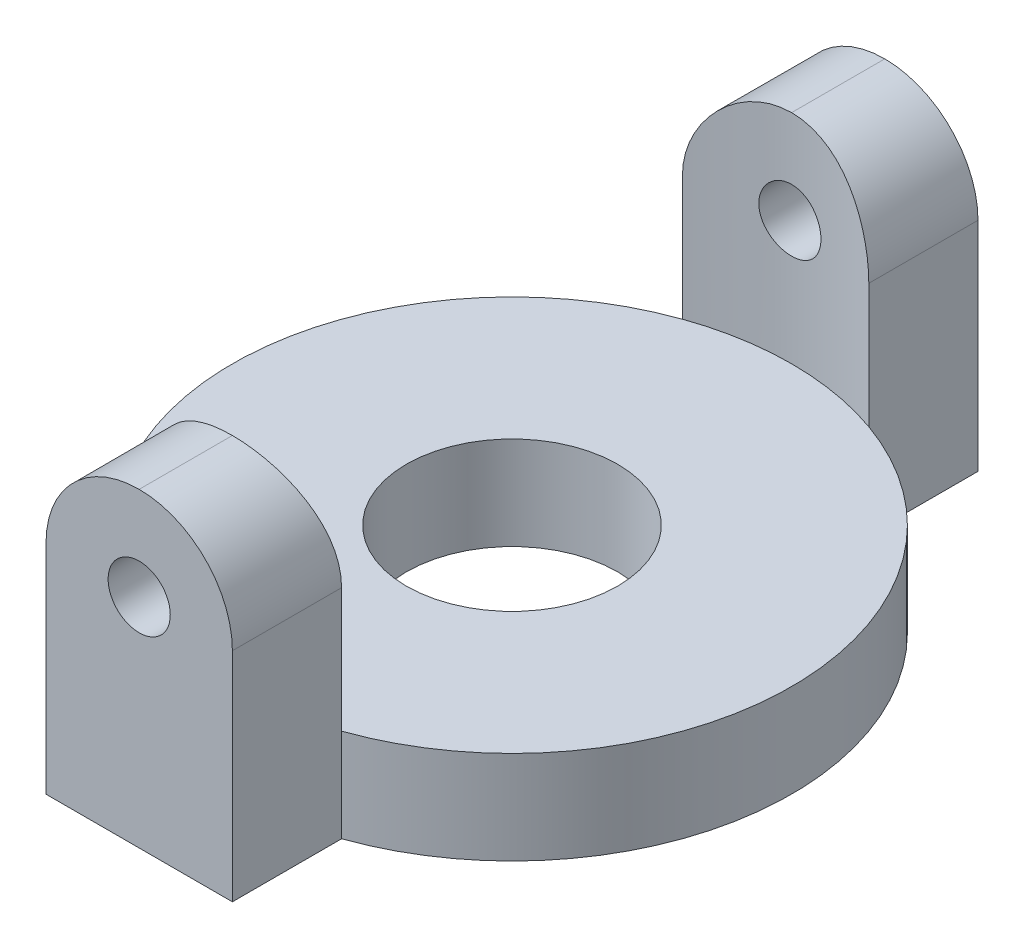
ISO-10303-21;
HEADER;
FILE_DESCRIPTION(('STEP AP214'),'2;1');
FILE_NAME('part.step','',(''),(''),'','','');
FILE_SCHEMA(('AUTOMOTIVE_DESIGN { 1 0 10303 214 1 1 1 1 }'));
ENDSEC;
DATA;
#1=APPLICATION_CONTEXT('core data for automotive mechanical design processes');
#2=APPLICATION_PROTOCOL_DEFINITION('international standard','automotive_design',2000,#1);
#3=PRODUCT_CONTEXT('',#1,'mechanical');
#4=PRODUCT('Part','Part','',(#3));
#5=PRODUCT_RELATED_PRODUCT_CATEGORY('part','',(#4));
#6=PRODUCT_DEFINITION_FORMATION('','',#4);
#7=PRODUCT_DEFINITION_CONTEXT('part definition',#1,'design');
#8=PRODUCT_DEFINITION('design','',#6,#7);
#9=PRODUCT_DEFINITION_SHAPE('','',#8);
#10=(LENGTH_UNIT() NAMED_UNIT(*) SI_UNIT(.MILLI.,.METRE.));
#11=(NAMED_UNIT(*) PLANE_ANGLE_UNIT() SI_UNIT($,.RADIAN.));
#12=(NAMED_UNIT(*) SI_UNIT($,.STERADIAN.) SOLID_ANGLE_UNIT());
#13=UNCERTAINTY_MEASURE_WITH_UNIT(LENGTH_MEASURE(1.E-05),#10,'distance_accuracy_value','');
#14=(GEOMETRIC_REPRESENTATION_CONTEXT(3) GLOBAL_UNCERTAINTY_ASSIGNED_CONTEXT((#13)) GLOBAL_UNIT_ASSIGNED_CONTEXT((#10,
#11,#12)) REPRESENTATION_CONTEXT('',''));
#15=CARTESIAN_POINT('',(0.,0.,0.));
#16=DIRECTION('',(0.,0.,1.));
#17=DIRECTION('',(1.,0.,0.));
#18=AXIS2_PLACEMENT_3D('',#15,#16,#17);
#19=CARTESIAN_POINT('',(0.,1.5,0.));
#20=DIRECTION('',(0.,-1.,0.));
#21=DIRECTION('',(0.,0.,-1.));
#22=AXIS2_PLACEMENT_3D('',#19,#20,#21);
#23=CYLINDRICAL_SURFACE('',#22,4.5);
#24=DIRECTION('',(0.,-1.,0.));
#25=VECTOR('',#24,1.);
#26=CARTESIAN_POINT('',(-1.5,5.,-4.24264068711928));
#27=LINE('',#26,#25);
#28=CARTESIAN_POINT('',(-1.5,1.5,-4.24264068711928));
#29=VERTEX_POINT('',#28);
#30=CARTESIAN_POINT('',(-1.5,0.,-4.24264068711928));
#31=VERTEX_POINT('',#30);
#32=EDGE_CURVE('E140',#29,#31,#27,.T.);
#33=ORIENTED_EDGE('',*,*,#32,.T.);
#34=CARTESIAN_POINT('',(0.,0.,0.));
#35=DIRECTION('',(0.,1.,0.));
#36=DIRECTION('',(0.,0.,1.));
#37=AXIS2_PLACEMENT_3D('',#34,#35,#36);
#38=CIRCLE('',#37,4.5);
#39=CARTESIAN_POINT('',(-1.5,0.,4.24264068711929));
#40=VERTEX_POINT('',#39);
#41=EDGE_CURVE('E122',#31,#40,#38,.T.);
#42=ORIENTED_EDGE('',*,*,#41,.T.);
#43=DIRECTION('',(0.,-1.,0.));
#44=VECTOR('',#43,1.);
#45=CARTESIAN_POINT('',(-1.5,1.5,4.24264068711929));
#46=LINE('',#45,#44);
#47=CARTESIAN_POINT('',(-1.5,1.5,4.24264068711928));
#48=VERTEX_POINT('',#47);
#49=EDGE_CURVE('E197',#48,#40,#46,.T.);
#50=ORIENTED_EDGE('',*,*,#49,.F.);
#51=CARTESIAN_POINT('',(0.,1.5,0.));
#52=DIRECTION('',(0.,1.,0.));
#53=DIRECTION('',(0.,0.,1.));
#54=AXIS2_PLACEMENT_3D('',#51,#52,#53);
#55=CIRCLE('',#54,4.5);
#56=EDGE_CURVE('E142',#29,#48,#55,.T.);
#57=ORIENTED_EDGE('',*,*,#56,.F.);
#58=EDGE_LOOP('',(#33,#42,#50,#57));
#59=FACE_BOUND('',#58,.T.);
#60=ADVANCED_FACE('F34',(#59),#23,.T.);
#61=DIRECTION('',(0.,-1.,0.));
#62=VECTOR('',#61,1.);
#63=CARTESIAN_POINT('',(1.5,5.,-4.24264068711929));
#64=LINE('',#63,#62);
#65=CARTESIAN_POINT('',(1.5,1.5,-4.24264068711928));
#66=VERTEX_POINT('',#65);
#67=CARTESIAN_POINT('',(1.5,0.,-4.24264068711928));
#68=VERTEX_POINT('',#67);
#69=EDGE_CURVE('E171',#66,#68,#64,.T.);
#70=ORIENTED_EDGE('',*,*,#69,.F.);
#71=CARTESIAN_POINT('',(1.5,1.5,4.24264068711928));
#72=VERTEX_POINT('',#71);
#73=EDGE_CURVE('E195',#72,#66,#55,.T.);
#74=ORIENTED_EDGE('',*,*,#73,.F.);
#75=DIRECTION('',(0.,-1.,0.));
#76=VECTOR('',#75,1.);
#77=CARTESIAN_POINT('',(1.5,1.5,4.24264068711928));
#78=LINE('',#77,#76);
#79=CARTESIAN_POINT('',(1.5,0.,4.24264068711929));
#80=VERTEX_POINT('',#79);
#81=EDGE_CURVE('E201',#80,#72,#78,.F.);
#82=ORIENTED_EDGE('',*,*,#81,.F.);
#83=EDGE_CURVE('E135',#80,#68,#38,.T.);
#84=ORIENTED_EDGE('',*,*,#83,.T.);
#85=EDGE_LOOP('',(#70,#74,#82,#84));
#86=FACE_BOUND('',#85,.T.);
#87=ADVANCED_FACE('F239',(#86),#23,.T.);
#88=CARTESIAN_POINT('',(0.,1.5,0.));
#89=DIRECTION('',(0.,1.,0.));
#90=DIRECTION('',(0.,0.,1.));
#91=AXIS2_PLACEMENT_3D('',#88,#89,#90);
#92=PLANE('',#91);
#93=ORIENTED_EDGE('',*,*,#73,.T.);
#94=CARTESIAN_POINT('',(0.,1.5,0.));
#95=DIRECTION('',(0.,1.,0.));
#96=DIRECTION('',(0.,0.,1.));
#97=AXIS2_PLACEMENT_3D('',#94,#95,#96);
#98=CIRCLE('',#97,4.5);
#99=EDGE_CURVE('E173',#66,#29,#98,.T.);
#100=ORIENTED_EDGE('',*,*,#99,.T.);
#101=ORIENTED_EDGE('',*,*,#56,.T.);
#102=EDGE_CURVE('E198',#48,#72,#55,.T.);
#103=ORIENTED_EDGE('',*,*,#102,.T.);
#104=EDGE_LOOP('',(#93,#100,#101,#103));
#105=FACE_BOUND('',#104,.T.);
#106=CARTESIAN_POINT('',(0.,1.5,0.));
#107=DIRECTION('',(0.,1.,0.));
#108=DIRECTION('',(0.,0.,1.));
#109=AXIS2_PLACEMENT_3D('',#106,#107,#108);
#110=CIRCLE('',#109,1.7);
#111=CARTESIAN_POINT('',(0.,1.5,1.7));
#112=VERTEX_POINT('',#111);
#113=EDGE_CURVE('E136',#112,#112,#110,.T.);
#114=ORIENTED_EDGE('',*,*,#113,.F.);
#115=EDGE_LOOP('',(#114));
#116=FACE_BOUND('',#115,.T.);
#117=ADVANCED_FACE('F236',(#105,#116),#92,.T.);
#118=CARTESIAN_POINT('',(0.,0.,0.));
#119=DIRECTION('',(0.,1.,0.));
#120=DIRECTION('',(0.,0.,1.));
#121=AXIS2_PLACEMENT_3D('',#118,#119,#120);
#122=PLANE('',#121);
#123=ORIENTED_EDGE('',*,*,#83,.F.);
#124=DIRECTION('',(0.,0.,-1.));
#125=VECTOR('',#124,1.);
#126=CARTESIAN_POINT('',(1.5,0.,4.24264068711929));
#127=LINE('',#126,#125);
#128=CARTESIAN_POINT('',(1.5,0.,5.99999999999999));
#129=VERTEX_POINT('',#128);
#130=EDGE_CURVE('E175',#129,#80,#127,.T.);
#131=ORIENTED_EDGE('',*,*,#130,.F.);
#132=DIRECTION('',(1.,0.,0.));
#133=VECTOR('',#132,1.);
#134=CARTESIAN_POINT('',(-1.5,0.,5.99999999999999));
#135=LINE('',#134,#133);
#136=CARTESIAN_POINT('',(-1.5,0.,5.99999999999999));
#137=VERTEX_POINT('',#136);
#138=EDGE_CURVE('E179',#137,#129,#135,.T.);
#139=ORIENTED_EDGE('',*,*,#138,.F.);
#140=DIRECTION('',(0.,0.,1.));
#141=VECTOR('',#140,1.);
#142=CARTESIAN_POINT('',(-1.5,0.,4.24264068711928));
#143=LINE('',#142,#141);
#144=EDGE_CURVE('E131',#40,#137,#143,.T.);
#145=ORIENTED_EDGE('',*,*,#144,.F.);
#146=ORIENTED_EDGE('',*,*,#41,.F.);
#147=DIRECTION('',(0.,0.,1.));
#148=VECTOR('',#147,1.);
#149=CARTESIAN_POINT('',(-1.5,0.,-6.));
#150=LINE('',#149,#148);
#151=CARTESIAN_POINT('',(-1.5,0.,-6.));
#152=VERTEX_POINT('',#151);
#153=EDGE_CURVE('E128',#152,#31,#150,.T.);
#154=ORIENTED_EDGE('',*,*,#153,.F.);
#155=DIRECTION('',(-1.,0.,0.));
#156=VECTOR('',#155,1.);
#157=CARTESIAN_POINT('',(-1.5,0.,-6.));
#158=LINE('',#157,#156);
#159=CARTESIAN_POINT('',(1.5,0.,-6.));
#160=VERTEX_POINT('',#159);
#161=EDGE_CURVE('E156',#160,#152,#158,.T.);
#162=ORIENTED_EDGE('',*,*,#161,.F.);
#163=DIRECTION('',(0.,0.,-1.));
#164=VECTOR('',#163,1.);
#165=CARTESIAN_POINT('',(1.5,0.,-6.));
#166=LINE('',#165,#164);
#167=EDGE_CURVE('E152',#68,#160,#166,.T.);
#168=ORIENTED_EDGE('',*,*,#167,.F.);
#169=EDGE_LOOP('',(#123,#131,#139,#145,#146,#154,#162,#168));
#170=FACE_BOUND('',#169,.T.);
#171=CARTESIAN_POINT('',(0.,0.,0.));
#172=DIRECTION('',(0.,1.,0.));
#173=DIRECTION('',(0.,0.,1.));
#174=AXIS2_PLACEMENT_3D('',#171,#172,#173);
#175=CIRCLE('',#174,1.7);
#176=CARTESIAN_POINT('',(0.,0.,1.7));
#177=VERTEX_POINT('',#176);
#178=EDGE_CURVE('E190',#177,#177,#175,.T.);
#179=ORIENTED_EDGE('',*,*,#178,.T.);
#180=EDGE_LOOP('',(#179));
#181=FACE_BOUND('',#180,.T.);
#182=ADVANCED_FACE('F124',(#170,#181),#122,.F.);
#183=CARTESIAN_POINT('',(0.,1.5,0.));
#184=DIRECTION('',(0.,-1.,0.));
#185=DIRECTION('',(0.,0.,-1.));
#186=AXIS2_PLACEMENT_3D('',#183,#184,#185);
#187=CYLINDRICAL_SURFACE('',#186,1.7);
#188=ORIENTED_EDGE('',*,*,#113,.T.);
#189=EDGE_LOOP('',(#188));
#190=FACE_BOUND('',#189,.T.);
#191=ORIENTED_EDGE('',*,*,#178,.F.);
#192=EDGE_LOOP('',(#191));
#193=FACE_BOUND('',#192,.T.);
#194=ADVANCED_FACE('F231',(#190,#193),#187,.F.);
#195=CARTESIAN_POINT('',(1.5,5.,4.24264068711929));
#196=DIRECTION('',(-1.,0.,0.));
#197=DIRECTION('',(0.,0.,1.));
#198=AXIS2_PLACEMENT_3D('',#195,#196,#197);
#199=PLANE('',#198);
#200=DIRECTION('',(0.,-1.,0.));
#201=VECTOR('',#200,1.);
#202=CARTESIAN_POINT('',(1.5,5.,4.24264068711929));
#203=LINE('',#202,#201);
#204=CARTESIAN_POINT('',(1.5,3.5,4.24264068711929));
#205=VERTEX_POINT('',#204);
#206=EDGE_CURVE('E188',#205,#72,#203,.T.);
#207=ORIENTED_EDGE('',*,*,#206,.F.);
#208=DIRECTION('',(0.,0.,-1.));
#209=VECTOR('',#208,1.);
#210=CARTESIAN_POINT('',(1.5,3.5,5.99999999999999));
#211=LINE('',#210,#209);
#212=CARTESIAN_POINT('',(1.5,3.5,5.99999999999999));
#213=VERTEX_POINT('',#212);
#214=EDGE_CURVE('E261',#205,#213,#211,.F.);
#215=ORIENTED_EDGE('',*,*,#214,.T.);
#216=DIRECTION('',(0.,-1.,0.));
#217=VECTOR('',#216,1.);
#218=CARTESIAN_POINT('',(1.5,5.,5.99999999999999));
#219=LINE('',#218,#217);
#220=EDGE_CURVE('E182',#213,#129,#219,.T.);
#221=ORIENTED_EDGE('',*,*,#220,.T.);
#222=ORIENTED_EDGE('',*,*,#130,.T.);
#223=ORIENTED_EDGE('',*,*,#81,.T.);
#224=EDGE_LOOP('',(#207,#215,#221,#222,#223));
#225=FACE_BOUND('',#224,.T.);
#226=ADVANCED_FACE('F224',(#225),#199,.F.);
#227=CARTESIAN_POINT('',(0.,5.,0.));
#228=DIRECTION('',(0.,-1.,0.));
#229=DIRECTION('',(0.,0.,-1.));
#230=AXIS2_PLACEMENT_3D('',#227,#228,#229);
#231=CYLINDRICAL_SURFACE('',#230,4.5);
#232=CARTESIAN_POINT('',(0.5,3.5,4.47213595499958));
#233=CARTESIAN_POINT('',(0.499998796258938,3.52799205673855,4.47213631683783));
#234=CARTESIAN_POINT('',(0.497641411056238,3.55600219988225,4.47240160207655));
#235=CARTESIAN_POINT('',(0.488273639283176,3.61124467202846,4.47343382673447));
#236=CARTESIAN_POINT('',(0.481258235719832,3.63847612931242,4.47420130703794));
#237=CARTESIAN_POINT('',(0.462782304707468,3.69135330951255,4.47614994074426));
#238=CARTESIAN_POINT('',(0.451324606357619,3.71700002964918,4.47733083081853));
#239=CARTESIAN_POINT('',(0.424295034963049,3.76600125782328,4.47997290658838));
#240=CARTESIAN_POINT('',(0.408723931403472,3.78935619346004,4.48143403984552));
#241=CARTESIAN_POINT('',(0.373835165529888,3.83322012454534,4.48447925761171));
#242=CARTESIAN_POINT('',(0.354502878465011,3.85371745658957,4.48606380709555));
#243=CARTESIAN_POINT('',(0.31267189050312,3.89118376347665,4.4891731161395));
#244=CARTESIAN_POINT('',(0.290173039634354,3.90815257111055,4.49069787286338));
#245=CARTESIAN_POINT('',(0.242575243977716,3.93812118565091,4.49352047185626));
#246=CARTESIAN_POINT('',(0.217469691565487,3.9511105593084,4.49481771389023));
#247=CARTESIAN_POINT('',(0.165416867879499,3.97268480904972,4.49703403548833));
#248=CARTESIAN_POINT('',(0.138469651283893,3.98126981583283,4.49795312627391));
#249=CARTESIAN_POINT('',(0.0836170021554739,3.99375712330544,4.49930631949627));
#250=CARTESIAN_POINT('',(0.0557160073898263,3.99767869794708,4.4997424176232));
#251=CARTESIAN_POINT('',(-0.000351281196377822,4.00078749932574,4.50008728893842));
#252=CARTESIAN_POINT('',(-0.028517566623086,3.99997487535469,4.49999607875526));
#253=CARTESIAN_POINT('',(-0.0841849364698929,3.99365390880449,4.4992982357037));
#254=CARTESIAN_POINT('',(-0.11168840686845,3.98816629266205,4.49869387789913));
#255=CARTESIAN_POINT('',(-0.165381568624666,3.97268345036826,4.49704023493393));
#256=CARTESIAN_POINT('',(-0.191571239534311,3.96268815408341,4.49599094285074));
#257=CARTESIAN_POINT('',(-0.241958219879531,3.93845124219583,4.49356144944717));
#258=CARTESIAN_POINT('',(-0.266151122779296,3.92420053942206,4.49218054122816));
#259=CARTESIAN_POINT('',(-0.311809742357699,3.89186394232829,4.48924257756286));
#260=CARTESIAN_POINT('',(-0.333275360149761,3.87377790900936,4.4876855157334));
#261=CARTESIAN_POINT('',(-0.372991633663294,3.83416767922821,4.48455985288442));
#262=CARTESIAN_POINT('',(-0.391224296583186,3.812625438364,4.48299123496648));
#263=CARTESIAN_POINT('',(-0.423817577261928,3.76677661882866,4.48002760605913));
#264=CARTESIAN_POINT('',(-0.438178187012795,3.7424700344406,4.47863259542877));
#265=CARTESIAN_POINT('',(-0.462620092763435,3.69176775663256,4.47617407247949));
#266=CARTESIAN_POINT('',(-0.472700139952357,3.6653714562201,4.47511065692408));
#267=CARTESIAN_POINT('',(-0.488279833034219,3.61124649606052,4.47343768863573));
#268=CARTESIAN_POINT('',(-0.493779652082501,3.58351788672321,4.47282811874526));
#269=CARTESIAN_POINT('',(-0.500019339838921,3.52767377674124,4.47213490867971));
#270=CARTESIAN_POINT('',(-0.500784442709691,3.49956112885168,4.47204848042096));
#271=CARTESIAN_POINT('',(-0.497599379775538,3.44360804324216,4.47240397596441));
#272=CARTESIAN_POINT('',(-0.493649292951552,3.41576760097054,4.47284589091669));
#273=CARTESIAN_POINT('',(-0.481167147968896,3.36122362866508,4.47420574128358));
#274=CARTESIAN_POINT('',(-0.472647141189711,3.33451730683105,4.47512242446458));
#275=CARTESIAN_POINT('',(-0.451279353497476,3.28291265720402,4.47732751023909));
#276=CARTESIAN_POINT('',(-0.438431451110153,3.2580143801826,4.47861592326608));
#277=CARTESIAN_POINT('',(-0.408709852582638,3.2106179267016,4.48142601907117));
#278=CARTESIAN_POINT('',(-0.391819507189018,3.18813024826548,4.48294865701253));
#279=CARTESIAN_POINT('',(-0.354516203482382,3.14630006569152,4.48605256984938));
#280=CARTESIAN_POINT('',(-0.334103137306587,3.12695765789448,4.48763384653916));
#281=CARTESIAN_POINT('',(-0.290224052430823,3.09187937866994,4.49068534813512));
#282=CARTESIAN_POINT('',(-0.266744791682998,3.07616001918046,4.49215504490399));
#283=CARTESIAN_POINT('',(-0.217464789909244,3.0488879357933,4.49481002019907));
#284=CARTESIAN_POINT('',(-0.191664087088226,3.03733514334041,4.49599530340481));
#285=CARTESIAN_POINT('',(-0.138530066236483,3.01875181777572,4.49794553624093));
#286=CARTESIAN_POINT('',(-0.111200207891706,3.01171149199855,4.49871139554836));
#287=CARTESIAN_POINT('',(-0.0557373001894795,3.00232102963312,4.49974024173148));
#288=CARTESIAN_POINT('',(-0.0276042791183333,2.99997072807473,4.50000324629492));
#289=CARTESIAN_POINT('',(0.0285045836242232,3.00002966593315,4.49999670989338));
#290=CARTESIAN_POINT('',(0.0564804559611491,3.00241334539354,4.49973002883372));
#291=CARTESIAN_POINT('',(0.111631579231616,3.01181875919525,4.49869974216837));
#292=CARTESIAN_POINT('',(0.138806829978736,3.0188404946165,4.49793613644699));
#293=CARTESIAN_POINT('',(0.191583769153938,3.03731521100935,4.49599748860118));
#294=CARTESIAN_POINT('',(0.21718579401922,3.04876724070593,4.49482253480677));
#295=CARTESIAN_POINT('',(0.266108479162407,3.07577479599138,4.49219179954605));
#296=CARTESIAN_POINT('',(0.289429135693031,3.09133032832034,4.49073601761846));
#297=CARTESIAN_POINT('',(0.333257974625186,3.12619872410426,4.48769707420742));
#298=CARTESIAN_POINT('',(0.353750962910306,3.14553063284926,4.48611329196913));
#299=CARTESIAN_POINT('',(0.391212708976868,3.18736433226965,4.48300200041652));
#300=CARTESIAN_POINT('',(0.408180624928168,3.2098668779834,4.48147450461556));
#301=CARTESIAN_POINT('',(0.43815353346288,3.25748079491843,4.47864371441807));
#302=CARTESIAN_POINT('',(0.451146160413467,3.28259998716446,4.47734112498709));
#303=CARTESIAN_POINT('',(0.472711119742627,3.33466285921085,4.47511595281915));
#304=CARTESIAN_POINT('',(0.481288363806246,3.36160447381737,4.47419294806205));
#305=CARTESIAN_POINT('',(0.491675607887105,3.40724446873612,4.47306063275321));
#306=CARTESIAN_POINT('',(0.494792896917113,3.42565259057992,4.47271555435831));
#307=CARTESIAN_POINT('',(0.498955488305529,3.46270446576733,4.47225309555809));
#308=CARTESIAN_POINT('',(0.500000802081688,3.48134821781191,4.47213571389803));
#309=CARTESIAN_POINT('',(0.5,3.5,4.47213595499958));
#310=B_SPLINE_CURVE_WITH_KNOTS('',3,(#232,#233,#234,#235,#236,#237,#238,#239,#240,#241,#242,
#243,#244,#245,#246,#247,#248,#249,#250,#251,#252,#253,#254,#255,#256,#257,#258,#259,#260,#261,
#262,#263,#264,#265,#266,#267,#268,#269,#270,#271,#272,#273,#274,#275,#276,#277,#278,#279,#280,
#281,#282,#283,#284,#285,#286,#287,#288,#289,#290,#291,#292,#293,#294,#295,#296,#297,#298,#299,
#300,#301,#302,#303,#304,#305,#306,#307,#308,#309),.UNSPECIFIED.,.T.,.F.,(4,2,2,2,2,2,2,2,2,2,2,
2,2,2,2,2,2,2,2,2,2,2,2,2,2,2,2,2,2,2,2,2,2,2,2,2,2,2,4),(0.,0.0839080471562434,
0.167906615733664,0.251851777012508,0.335781245971832,0.420043829838857,0.504310405813132,
0.588796056980267,0.673279200896485,0.757411949034893,0.841542044079722,0.925301080438417,
1.00906142002098,1.09300191981289,1.17694546227213,1.26134244766376,1.34573960759957,
1.4301613726663,1.51457994602667,1.59854821157639,1.68251507065048,1.76626158082215,
1.85001044176548,1.93411035443122,2.01821284262334,2.10269136332634,2.18716849398641,
2.27146167147656,2.35575188392862,2.43958822950105,2.5234245945942,2.60724296828353,
2.69106147964711,2.7753141640723,2.85958694599262,2.94411926455323,3.02855734479845,
3.08446760742393,3.14037756195152),.UNSPECIFIED.);
#311=CARTESIAN_POINT('',(0.5,3.5,4.47213595499958));
#312=VERTEX_POINT('',#311);
#313=EDGE_CURVE('E153',#312,#312,#310,.T.);
#314=ORIENTED_EDGE('',*,*,#313,.T.);
#315=EDGE_LOOP('',(#314));
#316=FACE_BOUND('',#315,.T.);
#317=CARTESIAN_POINT('',(-1.5,3.5,4.24264068711928));
#318=CARTESIAN_POINT('',(-1.50000112134656,3.54093721716919,4.24263663033288));
#319=CARTESIAN_POINT('',(-1.49832306608281,3.58185353732505,4.24323394165824));
#320=CARTESIAN_POINT('',(-1.49163781016505,3.66336872554215,4.24559012084782));
#321=CARTESIAN_POINT('',(-1.48663150863116,3.70396767634404,4.24734867500338));
#322=CARTESIAN_POINT('',(-1.46671458530407,3.82459392588194,4.25428687458707));
#323=CARTESIAN_POINT('',(-1.44690540469993,3.90377404010314,4.26112969921784));
#324=CARTESIAN_POINT('',(-1.39493809121831,4.05743641175019,4.27842096559676));
#325=CARTESIAN_POINT('',(-1.3627865487148,4.13192115166694,4.28886748280241));
#326=CARTESIAN_POINT('',(-1.28711136195107,4.27450732643787,4.3121813519221));
#327=CARTESIAN_POINT('',(-1.24358033092266,4.34260457582048,4.325050274768));
#328=CARTESIAN_POINT('',(-1.14457783238329,4.47307952106675,4.35231702831385));
#329=CARTESIAN_POINT('',(-1.08873933051181,4.5351707218686,4.36675277826479));
#330=CARTESIAN_POINT('',(-0.967483744870977,4.6493078576357,4.39520742930769));
#331=CARTESIAN_POINT('',(-0.902064728075418,4.70135176046937,4.40922624558809));
#332=CARTESIAN_POINT('',(-0.76138461349377,4.79523412904131,4.43571238785826));
#333=CARTESIAN_POINT('',(-0.685909172807705,4.83676668291543,4.44812894576878));
#334=CARTESIAN_POINT('',(-0.528583786812303,4.90640791509429,4.46955051041029));
#335=CARTESIAN_POINT('',(-0.446739935091196,4.93452924654045,4.47855873115409));
#336=CARTESIAN_POINT('',(-0.303779953731051,4.9701841273093,4.49012728845024));
#337=CARTESIAN_POINT('',(-0.243633102900633,4.98133815168233,4.49380420311035));
#338=CARTESIAN_POINT('',(-0.12233725381375,4.99625579262668,4.49875192395406));
#339=CARTESIAN_POINT('',(-0.061188298778958,5.00001972709786,4.50002283363683));
#340=CARTESIAN_POINT('',(0.,5.,4.5));
#341=B_SPLINE_CURVE_WITH_KNOTS('',3,(#317,#318,#319,#320,#321,#322,#323,#324,#325,#326,#327,
#328,#329,#330,#331,#332,#333,#334,#335,#336,#337,#338,#339,#340),.UNSPECIFIED.,.F.,.F.,(4,2,2,
2,2,2,2,2,2,2,2,4),(0.,0.122732139205529,0.245431135996246,0.48987182125998,0.734182165200974,
0.978651493847181,1.23174453983062,1.48488872202718,1.74472012780037,2.00430590199827,
2.18767805820277,2.37104232610552),.UNSPECIFIED.);
#342=CARTESIAN_POINT('',(-1.5,3.5,4.24264068711928));
#343=VERTEX_POINT('',#342);
#344=CARTESIAN_POINT('',(0.,5.,4.5));
#345=VERTEX_POINT('',#344);
#346=EDGE_CURVE('E204',#343,#345,#341,.T.);
#347=ORIENTED_EDGE('',*,*,#346,.T.);
#348=CARTESIAN_POINT('',(0.,5.,4.5));
#349=CARTESIAN_POINT('',(0.0410012723748001,5.00000095118827,4.50000303064485));
#350=CARTESIAN_POINT('',(0.0819818716020842,4.99831780221792,4.4994389660988));
#351=CARTESIAN_POINT('',(0.163629335917812,4.99161114917866,4.49720902838356));
#352=CARTESIAN_POINT('',(0.204296270874998,4.98658841209556,4.49554340820339));
#353=CARTESIAN_POINT('',(0.325150756215589,4.96660031129065,4.48895847886442));
#354=CARTESIAN_POINT('',(0.404496015911142,4.94671457420379,4.48245062230506));
#355=CARTESIAN_POINT('',(0.558498782254199,4.89452476993618,4.46588112197307));
#356=CARTESIAN_POINT('',(0.633157949406864,4.86222513082113,4.4558207454958));
#357=CARTESIAN_POINT('',(0.77603606232966,4.78620312746187,4.4331708886759));
#358=CARTESIAN_POINT('',(0.84425155277699,4.74247468150481,4.42058006260922));
#359=CARTESIAN_POINT('',(0.974610703926994,4.64326345517108,4.39371200111939));
#360=CARTESIAN_POINT('',(1.03650056134328,4.58745829460941,4.37939458490155));
#361=CARTESIAN_POINT('',(1.15024455281548,4.46635421054367,4.35090585842825));
#362=CARTESIAN_POINT('',(1.20209564072474,4.40105241589053,4.33673459375182));
#363=CARTESIAN_POINT('',(1.29575508765384,4.26049733525053,4.30969496516864));
#364=CARTESIAN_POINT('',(1.33722729576848,4.18500975932594,4.29687651595735));
#365=CARTESIAN_POINT('',(1.40675110843491,4.02766602018009,4.27462174862172));
#366=CARTESIAN_POINT('',(1.43481691224254,3.94581670227978,4.26518185480499));
#367=CARTESIAN_POINT('',(1.47033666039617,3.80300392308943,4.25304094390975));
#368=CARTESIAN_POINT('',(1.48143156288945,3.7430217254825,4.2491726329493));
#369=CARTESIAN_POINT('',(1.49627387221908,3.6220403874751,4.24395814007097));
#370=CARTESIAN_POINT('',(1.50002014455821,3.56104109151856,4.24261234758631));
#371=CARTESIAN_POINT('',(1.5,3.5,4.24264068711929));
#372=B_SPLINE_CURVE_WITH_KNOTS('',3,(#348,#349,#350,#351,#352,#353,#354,#355,#356,#357,#358,
#359,#360,#361,#362,#363,#364,#365,#366,#367,#368,#369,#370,#371),.UNSPECIFIED.,.F.,.F.,(4,2,2,
2,2,2,2,2,2,2,2,4),(0.,0.122924925323012,0.245821628865433,0.490715029998899,0.735521158078521,
0.980457823205991,1.2329880356383,1.48559475571054,1.74555232117806,2.00523394139159,
2.18812364237125,2.37104157603212),.UNSPECIFIED.);
#373=EDGE_CURVE('E210',#345,#205,#372,.T.);
#374=ORIENTED_EDGE('',*,*,#373,.T.);
#375=ORIENTED_EDGE('',*,*,#206,.T.);
#376=ORIENTED_EDGE('',*,*,#102,.F.);
#377=DIRECTION('',(0.,-1.,0.));
#378=VECTOR('',#377,1.);
#379=CARTESIAN_POINT('',(-1.5,5.,4.24264068711928));
#380=LINE('',#379,#378);
#381=EDGE_CURVE('E186',#343,#48,#380,.T.);
#382=ORIENTED_EDGE('',*,*,#381,.F.);
#383=EDGE_LOOP('',(#347,#374,#375,#376,#382));
#384=FACE_BOUND('',#383,.T.);
#385=ADVANCED_FACE('F218',(#316,#384),#231,.F.);
#386=CARTESIAN_POINT('',(-1.5,5.,4.24264068711928));
#387=DIRECTION('',(1.,0.,0.));
#388=DIRECTION('',(0.,0.,-1.));
#389=AXIS2_PLACEMENT_3D('',#386,#387,#388);
#390=PLANE('',#389);
#391=DIRECTION('',(0.,-1.,0.));
#392=VECTOR('',#391,1.);
#393=CARTESIAN_POINT('',(-1.5,5.,5.99999999999999));
#394=LINE('',#393,#392);
#395=CARTESIAN_POINT('',(-1.5,3.5,5.99999999999999));
#396=VERTEX_POINT('',#395);
#397=EDGE_CURVE('E184',#396,#137,#394,.T.);
#398=ORIENTED_EDGE('',*,*,#397,.F.);
#399=DIRECTION('',(0.,0.,1.));
#400=VECTOR('',#399,1.);
#401=CARTESIAN_POINT('',(-1.5,3.5,4.24264068711928));
#402=LINE('',#401,#400);
#403=EDGE_CURVE('E267',#396,#343,#402,.F.);
#404=ORIENTED_EDGE('',*,*,#403,.T.);
#405=ORIENTED_EDGE('',*,*,#381,.T.);
#406=ORIENTED_EDGE('',*,*,#49,.T.);
#407=ORIENTED_EDGE('',*,*,#144,.T.);
#408=EDGE_LOOP('',(#398,#404,#405,#406,#407));
#409=FACE_BOUND('',#408,.T.);
#410=ADVANCED_FACE('F223',(#409),#390,.F.);
#411=CARTESIAN_POINT('',(-1.5,5.,5.99999999999999));
#412=DIRECTION('',(0.,0.,-1.));
#413=DIRECTION('',(-1.,0.,0.));
#414=AXIS2_PLACEMENT_3D('',#411,#412,#413);
#415=PLANE('',#414);
#416=CARTESIAN_POINT('',(0.,3.5,5.99999999999999));
#417=DIRECTION('',(0.,0.,1.));
#418=DIRECTION('',(1.,0.,0.));
#419=AXIS2_PLACEMENT_3D('',#416,#417,#418);
#420=CIRCLE('',#419,0.5);
#421=CARTESIAN_POINT('',(0.5,3.5,5.99999999999999));
#422=VERTEX_POINT('',#421);
#423=EDGE_CURVE('E322',#422,#422,#420,.T.);
#424=ORIENTED_EDGE('',*,*,#423,.F.);
#425=EDGE_LOOP('',(#424));
#426=FACE_BOUND('',#425,.T.);
#427=ORIENTED_EDGE('',*,*,#220,.F.);
#428=CARTESIAN_POINT('',(0.,3.5,5.99999999999999));
#429=DIRECTION('',(0.,0.,-1.));
#430=DIRECTION('',(-1.,0.,0.));
#431=AXIS2_PLACEMENT_3D('',#428,#429,#430);
#432=CIRCLE('',#431,1.5);
#433=CARTESIAN_POINT('',(0.,5.,5.99999999999999));
#434=VERTEX_POINT('',#433);
#435=EDGE_CURVE('E258',#213,#434,#432,.F.);
#436=ORIENTED_EDGE('',*,*,#435,.T.);
#437=CARTESIAN_POINT('',(0.,3.5,5.99999999999999));
#438=DIRECTION('',(0.,0.,-1.));
#439=DIRECTION('',(-1.,0.,0.));
#440=AXIS2_PLACEMENT_3D('',#437,#438,#439);
#441=CIRCLE('',#440,1.5);
#442=EDGE_CURVE('E268',#434,#396,#441,.F.);
#443=ORIENTED_EDGE('',*,*,#442,.T.);
#444=ORIENTED_EDGE('',*,*,#397,.T.);
#445=ORIENTED_EDGE('',*,*,#138,.T.);
#446=EDGE_LOOP('',(#427,#436,#443,#444,#445));
#447=FACE_BOUND('',#446,.T.);
#448=ADVANCED_FACE('F271',(#426,#447),#415,.F.);
#449=CARTESIAN_POINT('',(-1.5,5.,-6.));
#450=DIRECTION('',(1.,0.,0.));
#451=DIRECTION('',(0.,0.,-1.));
#452=AXIS2_PLACEMENT_3D('',#449,#450,#451);
#453=PLANE('',#452);
#454=CARTESIAN_POINT('',(-1.5,3.5,-4.24264068711928));
#455=VERTEX_POINT('',#454);
#456=EDGE_CURVE('E145',#455,#29,#27,.T.);
#457=ORIENTED_EDGE('',*,*,#456,.F.);
#458=DIRECTION('',(0.,0.,1.));
#459=VECTOR('',#458,1.);
#460=CARTESIAN_POINT('',(-1.5,3.5,-6.));
#461=LINE('',#460,#459);
#462=CARTESIAN_POINT('',(-1.5,3.5,-6.));
#463=VERTEX_POINT('',#462);
#464=EDGE_CURVE('E11',#455,#463,#461,.F.);
#465=ORIENTED_EDGE('',*,*,#464,.T.);
#466=DIRECTION('',(0.,-1.,0.));
#467=VECTOR('',#466,1.);
#468=CARTESIAN_POINT('',(-1.5,5.,-6.));
#469=LINE('',#468,#467);
#470=EDGE_CURVE('E150',#463,#152,#469,.T.);
#471=ORIENTED_EDGE('',*,*,#470,.T.);
#472=ORIENTED_EDGE('',*,*,#153,.T.);
#473=ORIENTED_EDGE('',*,*,#32,.F.);
#474=EDGE_LOOP('',(#457,#465,#471,#472,#473));
#475=FACE_BOUND('',#474,.T.);
#476=ADVANCED_FACE('F148',(#475),#453,.F.);
#477=CARTESIAN_POINT('',(0.,5.,0.));
#478=DIRECTION('',(0.,-1.,0.));
#479=DIRECTION('',(0.,0.,-1.));
#480=AXIS2_PLACEMENT_3D('',#477,#478,#479);
#481=CYLINDRICAL_SURFACE('',#480,4.5);
#482=CARTESIAN_POINT('',(0.5,3.5,-4.47213595499958));
#483=CARTESIAN_POINT('',(0.499998796258938,3.47200794326145,-4.47213631683783));
#484=CARTESIAN_POINT('',(0.497641411056238,3.44399780011775,-4.47240160207655));
#485=CARTESIAN_POINT('',(0.488273639283176,3.38875532797154,-4.47343382673447));
#486=CARTESIAN_POINT('',(0.481258235719832,3.36152387068758,-4.47420130703794));
#487=CARTESIAN_POINT('',(0.462782304707469,3.30864669048745,-4.47614994074426));
#488=CARTESIAN_POINT('',(0.451324606357619,3.28299997035082,-4.47733083081853));
#489=CARTESIAN_POINT('',(0.424295034963049,3.23399874217672,-4.47997290658838));
#490=CARTESIAN_POINT('',(0.408723931403472,3.21064380653996,-4.48143403984552));
#491=CARTESIAN_POINT('',(0.373835165529888,3.16677987545467,-4.48447925761171));
#492=CARTESIAN_POINT('',(0.354502878465011,3.14628254341043,-4.48606380709555));
#493=CARTESIAN_POINT('',(0.31267189050312,3.10881623652335,-4.4891731161395));
#494=CARTESIAN_POINT('',(0.290173039634355,3.09184742888945,-4.49069787286338));
#495=CARTESIAN_POINT('',(0.242575243977716,3.06187881434909,-4.49352047185626));
#496=CARTESIAN_POINT('',(0.217469691565487,3.0488894406916,-4.49481771389023));
#497=CARTESIAN_POINT('',(0.165416867879499,3.02731519095028,-4.49703403548833));
#498=CARTESIAN_POINT('',(0.138469651283893,3.01873018416717,-4.49795312627391));
#499=CARTESIAN_POINT('',(0.0836170021554738,3.00624287669456,-4.49930631949627));
#500=CARTESIAN_POINT('',(0.0557160073898263,3.00232130205292,-4.4997424176232));
#501=CARTESIAN_POINT('',(-0.000351281196377835,2.99921250067426,-4.50008728893842));
#502=CARTESIAN_POINT('',(-0.028517566623086,3.00002512464532,-4.49999607875526));
#503=CARTESIAN_POINT('',(-0.0841849364698931,3.00634609119552,-4.4992982357037));
#504=CARTESIAN_POINT('',(-0.111688406868451,3.01183370733794,-4.49869387789913));
#505=CARTESIAN_POINT('',(-0.165381568624666,3.02731654963174,-4.49704023493393));
#506=CARTESIAN_POINT('',(-0.191571239534311,3.03731184591659,-4.49599094285074));
#507=CARTESIAN_POINT('',(-0.241958219879531,3.06154875780417,-4.49356144944717));
#508=CARTESIAN_POINT('',(-0.266151122779296,3.07579946057794,-4.49218054122816));
#509=CARTESIAN_POINT('',(-0.311809742357699,3.10813605767171,-4.48924257756286));
#510=CARTESIAN_POINT('',(-0.333275360149761,3.12622209099064,-4.4876855157334));
#511=CARTESIAN_POINT('',(-0.372991633663294,3.16583232077179,-4.48455985288442));
#512=CARTESIAN_POINT('',(-0.391224296583186,3.187374561636,-4.48299123496648));
#513=CARTESIAN_POINT('',(-0.423817577261928,3.23322338117134,-4.48002760605913));
#514=CARTESIAN_POINT('',(-0.438178187012795,3.2575299655594,-4.47863259542877));
#515=CARTESIAN_POINT('',(-0.462620092763435,3.30823224336744,-4.47617407247949));
#516=CARTESIAN_POINT('',(-0.472700139952357,3.3346285437799,-4.47511065692408));
#517=CARTESIAN_POINT('',(-0.488279833034219,3.38875350393948,-4.47343768863573));
#518=CARTESIAN_POINT('',(-0.493779652082501,3.41648211327679,-4.47282811874526));
#519=CARTESIAN_POINT('',(-0.500019339838921,3.47232622325876,-4.47213490867971));
#520=CARTESIAN_POINT('',(-0.500784442709691,3.50043887114832,-4.47204848042096));
#521=CARTESIAN_POINT('',(-0.497599379775538,3.55639195675784,-4.47240397596441));
#522=CARTESIAN_POINT('',(-0.493649292951552,3.58423239902946,-4.47284589091669));
#523=CARTESIAN_POINT('',(-0.481167147968896,3.63877637133492,-4.47420574128358));
#524=CARTESIAN_POINT('',(-0.472647141189711,3.66548269316895,-4.47512242446458));
#525=CARTESIAN_POINT('',(-0.451279353497476,3.71708734279598,-4.47732751023909));
#526=CARTESIAN_POINT('',(-0.438431451110152,3.7419856198174,-4.47861592326608));
#527=CARTESIAN_POINT('',(-0.408709852582638,3.7893820732984,-4.48142601907117));
#528=CARTESIAN_POINT('',(-0.391819507189017,3.81186975173452,-4.48294865701253));
#529=CARTESIAN_POINT('',(-0.354516203482382,3.85369993430848,-4.48605256984938));
#530=CARTESIAN_POINT('',(-0.334103137306587,3.87304234210552,-4.48763384653916));
#531=CARTESIAN_POINT('',(-0.290224052430823,3.90812062133006,-4.49068534813512));
#532=CARTESIAN_POINT('',(-0.266744791682998,3.92383998081954,-4.49215504490399));
#533=CARTESIAN_POINT('',(-0.217464789909244,3.9511120642067,-4.49481002019907));
#534=CARTESIAN_POINT('',(-0.191664087088225,3.96266485665959,-4.49599530340481));
#535=CARTESIAN_POINT('',(-0.138530066236483,3.98124818222429,-4.49794553624093));
#536=CARTESIAN_POINT('',(-0.111200207891706,3.98828850800145,-4.49871139554836));
#537=CARTESIAN_POINT('',(-0.0557373001894793,3.99767897036688,-4.49974024173148));
#538=CARTESIAN_POINT('',(-0.0276042791183331,4.00002927192527,-4.50000324629492));
#539=CARTESIAN_POINT('',(0.0285045836242234,3.99997033406685,-4.49999670989338));
#540=CARTESIAN_POINT('',(0.0564804559611494,3.99758665460646,-4.49973002883372));
#541=CARTESIAN_POINT('',(0.111631579231616,3.98818124080475,-4.49869974216837));
#542=CARTESIAN_POINT('',(0.138806829978737,3.9811595053835,-4.49793613644699));
#543=CARTESIAN_POINT('',(0.191583769153938,3.96268478899065,-4.49599748860118));
#544=CARTESIAN_POINT('',(0.21718579401922,3.95123275929407,-4.49482253480677));
#545=CARTESIAN_POINT('',(0.266108479162407,3.92422520400862,-4.49219179954605));
#546=CARTESIAN_POINT('',(0.289429135693031,3.90866967167966,-4.49073601761846));
#547=CARTESIAN_POINT('',(0.333257974625187,3.87380127589574,-4.48769707420742));
#548=CARTESIAN_POINT('',(0.353750962910307,3.85446936715074,-4.48611329196913));
#549=CARTESIAN_POINT('',(0.391212708976868,3.81263566773035,-4.48300200041652));
#550=CARTESIAN_POINT('',(0.408180624928168,3.7901331220166,-4.48147450461556));
#551=CARTESIAN_POINT('',(0.438153533462881,3.74251920508157,-4.47864371441808));
#552=CARTESIAN_POINT('',(0.451146160413467,3.71740001283554,-4.47734112498709));
#553=CARTESIAN_POINT('',(0.472711119742627,3.66533714078915,-4.47511595281915));
#554=CARTESIAN_POINT('',(0.481288363806246,3.63839552618263,-4.47419294806205));
#555=CARTESIAN_POINT('',(0.491675607887105,3.59275553126388,-4.47306063275321));
#556=CARTESIAN_POINT('',(0.494792896917113,3.57434740942008,-4.47271555435831));
#557=CARTESIAN_POINT('',(0.498955488305529,3.53729553423267,-4.47225309555809));
#558=CARTESIAN_POINT('',(0.500000802081688,3.51865178218809,-4.47213571389803));
#559=CARTESIAN_POINT('',(0.5,3.5,-4.47213595499958));
#560=B_SPLINE_CURVE_WITH_KNOTS('',3,(#482,#483,#484,#485,#486,#487,#488,#489,#490,#491,#492,
#493,#494,#495,#496,#497,#498,#499,#500,#501,#502,#503,#504,#505,#506,#507,#508,#509,#510,#511,
#512,#513,#514,#515,#516,#517,#518,#519,#520,#521,#522,#523,#524,#525,#526,#527,#528,#529,#530,
#531,#532,#533,#534,#535,#536,#537,#538,#539,#540,#541,#542,#543,#544,#545,#546,#547,#548,#549,
#550,#551,#552,#553,#554,#555,#556,#557,#558,#559),.UNSPECIFIED.,.T.,.F.,(4,2,2,2,2,2,2,2,2,2,2,
2,2,2,2,2,2,2,2,2,2,2,2,2,2,2,2,2,2,2,2,2,2,2,2,2,2,2,4),(0.,0.0839080471562434,
0.167906615733664,0.251851777012507,0.335781245971832,0.420043829838856,0.504310405813132,
0.588796056980267,0.673279200896484,0.757411949034893,0.841542044079722,0.925301080438417,
1.00906142002098,1.09300191981289,1.17694546227213,1.26134244766376,1.34573960759957,
1.4301613726663,1.51457994602667,1.59854821157639,1.68251507065048,1.76626158082215,
1.85001044176548,1.93411035443122,2.01821284262334,2.10269136332634,2.18716849398641,
2.27146167147656,2.35575188392862,2.43958822950105,2.5234245945942,2.60724296828353,
2.69106147964711,2.7753141640723,2.85958694599262,2.94411926455323,3.02855734479845,
3.08446760742393,3.14037756195152),.UNSPECIFIED.);
#561=CARTESIAN_POINT('',(0.5,3.5,-4.47213595499958));
#562=VERTEX_POINT('',#561);
#563=EDGE_CURVE('E159',#562,#562,#560,.T.);
#564=ORIENTED_EDGE('',*,*,#563,.T.);
#565=EDGE_LOOP('',(#564));
#566=FACE_BOUND('',#565,.T.);
#567=CARTESIAN_POINT('',(1.5,3.5,-4.24264068711929));
#568=VERTEX_POINT('',#567);
#569=EDGE_CURVE('E146',#568,#66,#64,.T.);
#570=ORIENTED_EDGE('',*,*,#569,.F.);
#571=CARTESIAN_POINT('',(1.5,3.5,-4.24264068711929));
#572=CARTESIAN_POINT('',(1.50000112134656,3.54093721716919,-4.24263663033288));
#573=CARTESIAN_POINT('',(1.49832306608281,3.58185353732505,-4.24323394165824));
#574=CARTESIAN_POINT('',(1.49163781016505,3.66336872554215,-4.24559012084782));
#575=CARTESIAN_POINT('',(1.48663150863116,3.70396767634404,-4.24734867500338));
#576=CARTESIAN_POINT('',(1.46671458530407,3.82459392588194,-4.25428687458707));
#577=CARTESIAN_POINT('',(1.44690540469993,3.90377404010314,-4.26112969921784));
#578=CARTESIAN_POINT('',(1.39493809121831,4.05743641175019,-4.27842096559676));
#579=CARTESIAN_POINT('',(1.3627865487148,4.13192115166694,-4.28886748280241));
#580=CARTESIAN_POINT('',(1.28711136195107,4.27450732643787,-4.3121813519221));
#581=CARTESIAN_POINT('',(1.24358033092267,4.34260457582048,-4.32505027476801));
#582=CARTESIAN_POINT('',(1.14457783238329,4.47307952106675,-4.35231702831385));
#583=CARTESIAN_POINT('',(1.08873933051181,4.5351707218686,-4.36675277826479));
#584=CARTESIAN_POINT('',(0.967483744870978,4.6493078576357,-4.3952074293077));
#585=CARTESIAN_POINT('',(0.90206472807542,4.70135176046937,-4.40922624558809));
#586=CARTESIAN_POINT('',(0.761384613493772,4.79523412904131,-4.43571238785826));
#587=CARTESIAN_POINT('',(0.685909172807707,4.83676668291543,-4.44812894576878));
#588=CARTESIAN_POINT('',(0.528583786812306,4.90640791509429,-4.46955051041029));
#589=CARTESIAN_POINT('',(0.446739935091199,4.93452924654045,-4.47855873115409));
#590=CARTESIAN_POINT('',(0.303779953731053,4.9701841273093,-4.49012728845024));
#591=CARTESIAN_POINT('',(0.243633102900635,4.98133815168233,-4.49380420311035));
#592=CARTESIAN_POINT('',(0.122337253813752,4.99625579262668,-4.49875192395406));
#593=CARTESIAN_POINT('',(0.0611882987789597,5.00001972709786,-4.50002283363683));
#594=CARTESIAN_POINT('',(0.,5.,-4.5));
#595=B_SPLINE_CURVE_WITH_KNOTS('',3,(#571,#572,#573,#574,#575,#576,#577,#578,#579,#580,#581,
#582,#583,#584,#585,#586,#587,#588,#589,#590,#591,#592,#593,#594),.UNSPECIFIED.,.F.,.F.,(4,2,2,
2,2,2,2,2,2,2,2,4),(0.,0.122732139205528,0.245431135996246,0.48987182125998,0.734182165200974,
0.978651493847181,1.23174453983062,1.48488872202718,1.74472012780037,2.00430590199827,
2.18767805820277,2.37104232610552),.UNSPECIFIED.);
#596=CARTESIAN_POINT('',(0.,5.,-4.5));
#597=VERTEX_POINT('',#596);
#598=EDGE_CURVE('E44',#568,#597,#595,.T.);
#599=ORIENTED_EDGE('',*,*,#598,.T.);
#600=CARTESIAN_POINT('',(0.,5.,-4.5));
#601=CARTESIAN_POINT('',(-0.041001272374798,5.00000095118827,-4.50000303064485));
#602=CARTESIAN_POINT('',(-0.0819818716020821,4.99831780221792,-4.4994389660988));
#603=CARTESIAN_POINT('',(-0.16362933591781,4.99161114917866,-4.49720902838356));
#604=CARTESIAN_POINT('',(-0.204296270874996,4.98658841209556,-4.49554340820339));
#605=CARTESIAN_POINT('',(-0.325150756215587,4.96660031129065,-4.48895847886442));
#606=CARTESIAN_POINT('',(-0.40449601591114,4.94671457420379,-4.48245062230506));
#607=CARTESIAN_POINT('',(-0.558498782254197,4.89452476993618,-4.46588112197307));
#608=CARTESIAN_POINT('',(-0.633157949406862,4.86222513082113,-4.4558207454958));
#609=CARTESIAN_POINT('',(-0.776036062329658,4.78620312746187,-4.4331708886759));
#610=CARTESIAN_POINT('',(-0.844251552776988,4.74247468150481,-4.42058006260922));
#611=CARTESIAN_POINT('',(-0.974610703926992,4.64326345517108,-4.39371200111939));
#612=CARTESIAN_POINT('',(-1.03650056134328,4.58745829460941,-4.37939458490155));
#613=CARTESIAN_POINT('',(-1.15024455281548,4.46635421054367,-4.35090585842825));
#614=CARTESIAN_POINT('',(-1.20209564072474,4.40105241589053,-4.33673459375182));
#615=CARTESIAN_POINT('',(-1.29575508765383,4.26049733525053,-4.30969496516864));
#616=CARTESIAN_POINT('',(-1.33722729576847,4.18500975932594,-4.29687651595735));
#617=CARTESIAN_POINT('',(-1.40675110843491,4.02766602018009,-4.27462174862172));
#618=CARTESIAN_POINT('',(-1.43481691224253,3.94581670227978,-4.26518185480499));
#619=CARTESIAN_POINT('',(-1.47033666039617,3.80300392308943,-4.25304094390975));
#620=CARTESIAN_POINT('',(-1.48143156288945,3.7430217254825,-4.2491726329493));
#621=CARTESIAN_POINT('',(-1.49627387221908,3.6220403874751,-4.24395814007097));
#622=CARTESIAN_POINT('',(-1.50002014455821,3.56104109151856,-4.24261234758631));
#623=CARTESIAN_POINT('',(-1.5,3.5,-4.24264068711928));
#624=B_SPLINE_CURVE_WITH_KNOTS('',3,(#600,#601,#602,#603,#604,#605,#606,#607,#608,#609,#610,
#611,#612,#613,#614,#615,#616,#617,#618,#619,#620,#621,#622,#623),.UNSPECIFIED.,.F.,.F.,(4,2,2,
2,2,2,2,2,2,2,2,4),(0.,0.122924925323012,0.245821628865433,0.490715029998899,0.735521158078521,
0.980457823205991,1.2329880356383,1.48559475571054,1.74555232117806,2.00523394139159,
2.18812364237125,2.37104157603212),.UNSPECIFIED.);
#625=EDGE_CURVE('E52',#597,#455,#624,.T.);
#626=ORIENTED_EDGE('',*,*,#625,.T.);
#627=ORIENTED_EDGE('',*,*,#456,.T.);
#628=ORIENTED_EDGE('',*,*,#99,.F.);
#629=EDGE_LOOP('',(#570,#599,#626,#627,#628));
#630=FACE_BOUND('',#629,.T.);
#631=ADVANCED_FACE('F284',(#566,#630),#481,.F.);
#632=CARTESIAN_POINT('',(1.5,5.,-6.));
#633=DIRECTION('',(-1.,0.,0.));
#634=DIRECTION('',(0.,0.,1.));
#635=AXIS2_PLACEMENT_3D('',#632,#633,#634);
#636=PLANE('',#635);
#637=DIRECTION('',(0.,-1.,0.));
#638=VECTOR('',#637,1.);
#639=CARTESIAN_POINT('',(1.5,5.,-6.));
#640=LINE('',#639,#638);
#641=CARTESIAN_POINT('',(1.5,3.5,-6.));
#642=VERTEX_POINT('',#641);
#643=EDGE_CURVE('E169',#642,#160,#640,.T.);
#644=ORIENTED_EDGE('',*,*,#643,.F.);
#645=DIRECTION('',(0.,0.,-1.));
#646=VECTOR('',#645,1.);
#647=CARTESIAN_POINT('',(1.5,3.5,-6.));
#648=LINE('',#647,#646);
#649=EDGE_CURVE('E294',#642,#568,#648,.F.);
#650=ORIENTED_EDGE('',*,*,#649,.T.);
#651=ORIENTED_EDGE('',*,*,#569,.T.);
#652=ORIENTED_EDGE('',*,*,#69,.T.);
#653=ORIENTED_EDGE('',*,*,#167,.T.);
#654=EDGE_LOOP('',(#644,#650,#651,#652,#653));
#655=FACE_BOUND('',#654,.T.);
#656=ADVANCED_FACE('F312',(#655),#636,.F.);
#657=CARTESIAN_POINT('',(-1.5,5.,-6.));
#658=DIRECTION('',(0.,0.,1.));
#659=DIRECTION('',(1.,0.,0.));
#660=AXIS2_PLACEMENT_3D('',#657,#658,#659);
#661=PLANE('',#660);
#662=CARTESIAN_POINT('',(0.,3.5,-6.));
#663=DIRECTION('',(0.,0.,1.));
#664=DIRECTION('',(1.,0.,0.));
#665=AXIS2_PLACEMENT_3D('',#662,#663,#664);
#666=CIRCLE('',#665,0.5);
#667=CARTESIAN_POINT('',(0.5,3.5,-6.));
#668=VERTEX_POINT('',#667);
#669=EDGE_CURVE('E321',#668,#668,#666,.T.);
#670=ORIENTED_EDGE('',*,*,#669,.T.);
#671=EDGE_LOOP('',(#670));
#672=FACE_BOUND('',#671,.T.);
#673=CARTESIAN_POINT('',(0.,3.5,-6.));
#674=DIRECTION('',(0.,0.,1.));
#675=DIRECTION('',(1.,0.,0.));
#676=AXIS2_PLACEMENT_3D('',#673,#674,#675);
#677=CIRCLE('',#676,1.5);
#678=CARTESIAN_POINT('',(0.,5.,-6.));
#679=VERTEX_POINT('',#678);
#680=EDGE_CURVE('E289',#463,#679,#677,.F.);
#681=ORIENTED_EDGE('',*,*,#680,.T.);
#682=CARTESIAN_POINT('',(0.,3.5,-6.));
#683=DIRECTION('',(0.,0.,1.));
#684=DIRECTION('',(1.,0.,0.));
#685=AXIS2_PLACEMENT_3D('',#682,#683,#684);
#686=CIRCLE('',#685,1.5);
#687=EDGE_CURVE('E292',#679,#642,#686,.F.);
#688=ORIENTED_EDGE('',*,*,#687,.T.);
#689=ORIENTED_EDGE('',*,*,#643,.T.);
#690=ORIENTED_EDGE('',*,*,#161,.T.);
#691=ORIENTED_EDGE('',*,*,#470,.F.);
#692=EDGE_LOOP('',(#681,#688,#689,#690,#691));
#693=FACE_BOUND('',#692,.T.);
#694=ADVANCED_FACE('F328',(#672,#693),#661,.F.);
#695=CARTESIAN_POINT('',(0.,3.5,-6.));
#696=DIRECTION('',(0.,0.,1.));
#697=DIRECTION('',(1.,0.,0.));
#698=AXIS2_PLACEMENT_3D('',#695,#696,#697);
#699=CYLINDRICAL_SURFACE('',#698,0.5);
#700=ORIENTED_EDGE('',*,*,#669,.F.);
#701=EDGE_LOOP('',(#700));
#702=FACE_BOUND('',#701,.T.);
#703=ORIENTED_EDGE('',*,*,#563,.F.);
#704=EDGE_LOOP('',(#703));
#705=FACE_BOUND('',#704,.T.);
#706=ADVANCED_FACE('F326',(#702,#705),#699,.F.);
#707=ORIENTED_EDGE('',*,*,#423,.T.);
#708=EDGE_LOOP('',(#707));
#709=FACE_BOUND('',#708,.T.);
#710=ORIENTED_EDGE('',*,*,#313,.F.);
#711=EDGE_LOOP('',(#710));
#712=FACE_BOUND('',#711,.T.);
#713=ADVANCED_FACE('F254',(#709,#712),#699,.F.);
#714=CARTESIAN_POINT('',(0.,3.5,0.));
#715=DIRECTION('',(0.,0.,-1.));
#716=DIRECTION('',(-1.,0.,0.));
#717=AXIS2_PLACEMENT_3D('',#714,#715,#716);
#718=CYLINDRICAL_SURFACE('',#717,1.5);
#719=ORIENTED_EDGE('',*,*,#403,.F.);
#720=ORIENTED_EDGE('',*,*,#442,.F.);
#721=DIRECTION('',(0.,0.,1.));
#722=VECTOR('',#721,1.);
#723=CARTESIAN_POINT('',(0.,5.,5.99999999999999));
#724=LINE('',#723,#722);
#725=EDGE_CURVE('E263',#345,#434,#724,.T.);
#726=ORIENTED_EDGE('',*,*,#725,.F.);
#727=ORIENTED_EDGE('',*,*,#346,.F.);
#728=EDGE_LOOP('',(#719,#720,#726,#727));
#729=FACE_BOUND('',#728,.T.);
#730=ADVANCED_FACE('F216',(#729),#718,.T.);
#731=CARTESIAN_POINT('',(0.,3.5,0.));
#732=DIRECTION('',(0.,0.,1.));
#733=DIRECTION('',(1.,0.,0.));
#734=AXIS2_PLACEMENT_3D('',#731,#732,#733);
#735=CYLINDRICAL_SURFACE('',#734,1.5);
#736=ORIENTED_EDGE('',*,*,#435,.F.);
#737=ORIENTED_EDGE('',*,*,#214,.F.);
#738=ORIENTED_EDGE('',*,*,#373,.F.);
#739=ORIENTED_EDGE('',*,*,#725,.T.);
#740=EDGE_LOOP('',(#736,#737,#738,#739));
#741=FACE_BOUND('',#740,.T.);
#742=ADVANCED_FACE('F244',(#741),#735,.T.);
#743=CARTESIAN_POINT('',(0.,3.5,0.));
#744=DIRECTION('',(0.,0.,1.));
#745=DIRECTION('',(1.,0.,0.));
#746=AXIS2_PLACEMENT_3D('',#743,#744,#745);
#747=CYLINDRICAL_SURFACE('',#746,1.5);
#748=ORIENTED_EDGE('',*,*,#464,.F.);
#749=ORIENTED_EDGE('',*,*,#625,.F.);
#750=DIRECTION('',(0.,0.,1.));
#751=VECTOR('',#750,1.);
#752=CARTESIAN_POINT('',(0.,5.,0.));
#753=LINE('',#752,#751);
#754=EDGE_CURVE('E39',#679,#597,#753,.T.);
#755=ORIENTED_EDGE('',*,*,#754,.F.);
#756=ORIENTED_EDGE('',*,*,#680,.F.);
#757=EDGE_LOOP('',(#748,#749,#755,#756));
#758=FACE_BOUND('',#757,.T.);
#759=ADVANCED_FACE('F36',(#758),#747,.T.);
#760=CARTESIAN_POINT('',(0.,3.5,0.));
#761=DIRECTION('',(0.,0.,-1.));
#762=DIRECTION('',(-1.,0.,0.));
#763=AXIS2_PLACEMENT_3D('',#760,#761,#762);
#764=CYLINDRICAL_SURFACE('',#763,1.5);
#765=ORIENTED_EDGE('',*,*,#598,.F.);
#766=ORIENTED_EDGE('',*,*,#649,.F.);
#767=ORIENTED_EDGE('',*,*,#687,.F.);
#768=ORIENTED_EDGE('',*,*,#754,.T.);
#769=EDGE_LOOP('',(#765,#766,#767,#768));
#770=FACE_BOUND('',#769,.T.);
#771=ADVANCED_FACE('F252',(#770),#764,.T.);
#772=CLOSED_SHELL('',(#60,#87,#117,#182,#194,#226,#385,#410,#448,#476,#631,#656,#694,#706,#713,
#730,#742,#759,#771));
#773=MANIFOLD_SOLID_BREP('B2',#772);
#774=ADVANCED_BREP_SHAPE_REPRESENTATION('',(#18,#773),#14);
#775=SHAPE_DEFINITION_REPRESENTATION(#9,#774);
ENDSEC;
END-ISO-10303-21;
